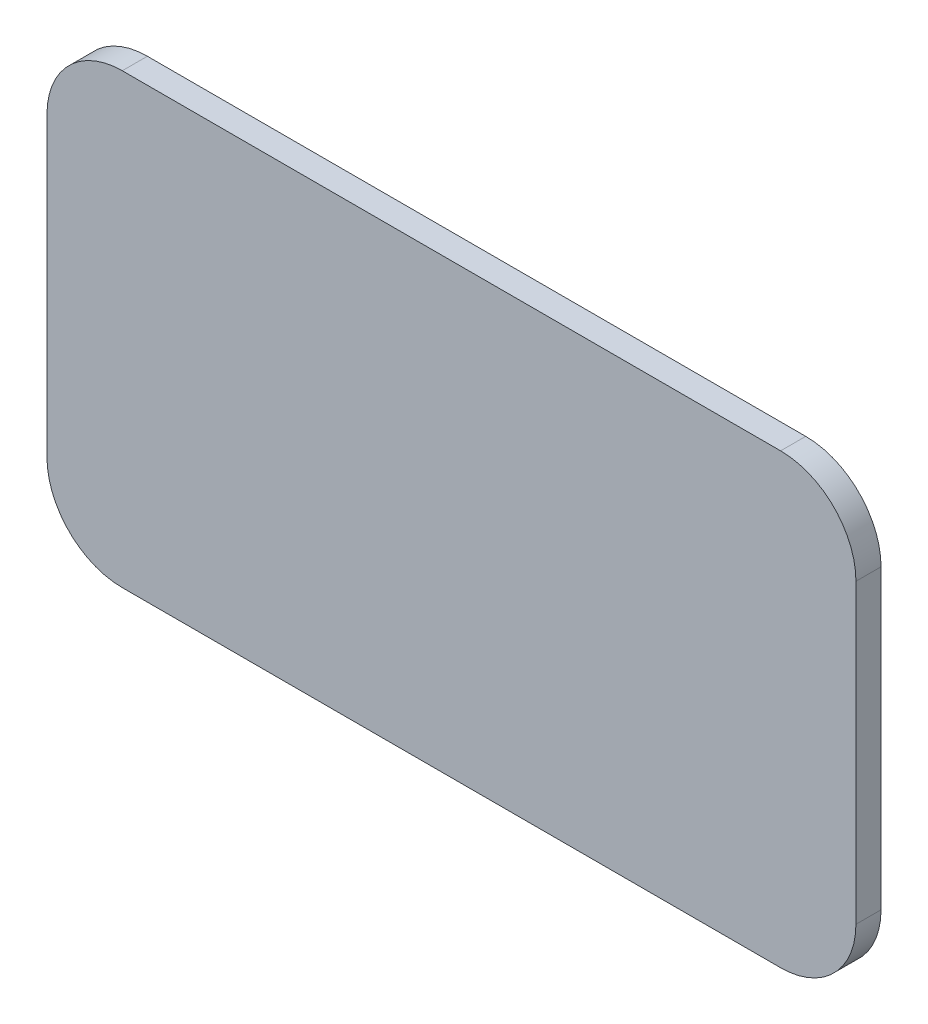
ISO-10303-21;
HEADER;
FILE_DESCRIPTION(('STEP AP214'),'2;1');
FILE_NAME('part.step','',(''),(''),'','','');
FILE_SCHEMA(('AUTOMOTIVE_DESIGN { 1 0 10303 214 1 1 1 1 }'));
ENDSEC;
DATA;
#1=APPLICATION_CONTEXT('core data for automotive mechanical design processes');
#2=APPLICATION_PROTOCOL_DEFINITION('international standard','automotive_design',2000,#1);
#3=PRODUCT_CONTEXT('',#1,'mechanical');
#4=PRODUCT('Part','Part','',(#3));
#5=PRODUCT_RELATED_PRODUCT_CATEGORY('part','',(#4));
#6=PRODUCT_DEFINITION_FORMATION('','',#4);
#7=PRODUCT_DEFINITION_CONTEXT('part definition',#1,'design');
#8=PRODUCT_DEFINITION('design','',#6,#7);
#9=PRODUCT_DEFINITION_SHAPE('','',#8);
#10=(LENGTH_UNIT() NAMED_UNIT(*) SI_UNIT(.MILLI.,.METRE.));
#11=(NAMED_UNIT(*) PLANE_ANGLE_UNIT() SI_UNIT($,.RADIAN.));
#12=(NAMED_UNIT(*) SI_UNIT($,.STERADIAN.) SOLID_ANGLE_UNIT());
#13=UNCERTAINTY_MEASURE_WITH_UNIT(LENGTH_MEASURE(1.E-05),#10,'distance_accuracy_value','');
#14=(GEOMETRIC_REPRESENTATION_CONTEXT(3) GLOBAL_UNCERTAINTY_ASSIGNED_CONTEXT((#13)) GLOBAL_UNIT_ASSIGNED_CONTEXT((#10,
#11,#12)) REPRESENTATION_CONTEXT('',''));
#15=CARTESIAN_POINT('',(0.,0.,0.));
#16=DIRECTION('',(0.,0.,1.));
#17=DIRECTION('',(1.,0.,0.));
#18=AXIS2_PLACEMENT_3D('',#15,#16,#17);
#19=CARTESIAN_POINT('',(-220.35,7.00000000000003,-6.));
#20=DIRECTION('',(0.,0.,1.));
#21=DIRECTION('',(-1.,0.,0.));
#22=AXIS2_PLACEMENT_3D('',#19,#20,#21);
#23=CYLINDRICAL_SURFACE('',#22,18.);
#24=CARTESIAN_POINT('',(-220.35,7.00000000000003,0.));
#25=DIRECTION('',(0.,0.,1.));
#26=DIRECTION('',(1.,0.,0.));
#27=AXIS2_PLACEMENT_3D('',#24,#25,#26);
#28=CIRCLE('',#27,18.);
#29=CARTESIAN_POINT('',(-238.35,7.00000000000002,0.));
#30=VERTEX_POINT('',#29);
#31=CARTESIAN_POINT('',(-220.35,-11.,0.));
#32=VERTEX_POINT('',#31);
#33=EDGE_CURVE('E131',#30,#32,#28,.T.);
#34=ORIENTED_EDGE('',*,*,#33,.F.);
#35=DIRECTION('',(0.,0.,1.));
#36=VECTOR('',#35,1.);
#37=CARTESIAN_POINT('',(-238.35,7.00000000000002,-6.));
#38=LINE('',#37,#36);
#39=CARTESIAN_POINT('',(-238.35,7.00000000000002,-6.));
#40=VERTEX_POINT('',#39);
#41=EDGE_CURVE('E130',#40,#30,#38,.T.);
#42=ORIENTED_EDGE('',*,*,#41,.F.);
#43=CARTESIAN_POINT('',(-220.35,7.00000000000003,-6.));
#44=DIRECTION('',(0.,0.,1.));
#45=DIRECTION('',(1.,0.,0.));
#46=AXIS2_PLACEMENT_3D('',#43,#44,#45);
#47=CIRCLE('',#46,18.);
#48=CARTESIAN_POINT('',(-220.35,-11.,-6.));
#49=VERTEX_POINT('',#48);
#50=EDGE_CURVE('E149',#40,#49,#47,.T.);
#51=ORIENTED_EDGE('',*,*,#50,.T.);
#52=DIRECTION('',(0.,0.,1.));
#53=VECTOR('',#52,1.);
#54=CARTESIAN_POINT('',(-220.35,-11.,-6.));
#55=LINE('',#54,#53);
#56=EDGE_CURVE('E11',#49,#32,#55,.T.);
#57=ORIENTED_EDGE('',*,*,#56,.T.);
#58=EDGE_LOOP('',(#34,#42,#51,#57));
#59=FACE_BOUND('',#58,.T.);
#60=ADVANCED_FACE('F35',(#59),#23,.T.);
#61=CARTESIAN_POINT('',(-220.35,-11.,-6.));
#62=DIRECTION('',(0.,1.,0.));
#63=DIRECTION('',(-1.,0.,0.));
#64=AXIS2_PLACEMENT_3D('',#61,#62,#63);
#65=PLANE('',#64);
#66=DIRECTION('',(1.,0.,0.));
#67=VECTOR('',#66,1.);
#68=CARTESIAN_POINT('',(-220.35,-11.,0.));
#69=LINE('',#68,#67);
#70=CARTESIAN_POINT('',(-62.991811866727,-11.,0.));
#71=VERTEX_POINT('',#70);
#72=EDGE_CURVE('E133',#32,#71,#69,.T.);
#73=ORIENTED_EDGE('',*,*,#72,.F.);
#74=ORIENTED_EDGE('',*,*,#56,.F.);
#75=DIRECTION('',(1.,0.,0.));
#76=VECTOR('',#75,1.);
#77=CARTESIAN_POINT('',(-220.35,-11.,-6.));
#78=LINE('',#77,#76);
#79=CARTESIAN_POINT('',(-62.991811866727,-11.,-6.));
#80=VERTEX_POINT('',#79);
#81=EDGE_CURVE('E89',#49,#80,#78,.T.);
#82=ORIENTED_EDGE('',*,*,#81,.T.);
#83=DIRECTION('',(0.,0.,1.));
#84=VECTOR('',#83,1.);
#85=CARTESIAN_POINT('',(-62.991811866727,-11.,-6.));
#86=LINE('',#85,#84);
#87=EDGE_CURVE('E43',#80,#71,#86,.T.);
#88=ORIENTED_EDGE('',*,*,#87,.T.);
#89=EDGE_LOOP('',(#73,#74,#82,#88));
#90=FACE_BOUND('',#89,.T.);
#91=ADVANCED_FACE('F161',(#90),#65,.F.);
#92=CARTESIAN_POINT('',(-62.991811866727,7.,-6.));
#93=DIRECTION('',(0.,0.,1.));
#94=DIRECTION('',(-1.,0.,0.));
#95=AXIS2_PLACEMENT_3D('',#92,#93,#94);
#96=CYLINDRICAL_SURFACE('',#95,18.);
#97=CARTESIAN_POINT('',(-62.991811866727,7.,0.));
#98=DIRECTION('',(0.,0.,1.));
#99=DIRECTION('',(1.,0.,0.));
#100=AXIS2_PLACEMENT_3D('',#97,#98,#99);
#101=CIRCLE('',#100,18.);
#102=CARTESIAN_POINT('',(-44.991811866727,7.,0.));
#103=VERTEX_POINT('',#102);
#104=EDGE_CURVE('E136',#71,#103,#101,.T.);
#105=ORIENTED_EDGE('',*,*,#104,.F.);
#106=ORIENTED_EDGE('',*,*,#87,.F.);
#107=CARTESIAN_POINT('',(-62.991811866727,7.,-6.));
#108=DIRECTION('',(0.,0.,1.));
#109=DIRECTION('',(1.,0.,0.));
#110=AXIS2_PLACEMENT_3D('',#107,#108,#109);
#111=CIRCLE('',#110,18.);
#112=CARTESIAN_POINT('',(-44.991811866727,7.,-6.));
#113=VERTEX_POINT('',#112);
#114=EDGE_CURVE('E170',#80,#113,#111,.T.);
#115=ORIENTED_EDGE('',*,*,#114,.T.);
#116=DIRECTION('',(0.,0.,1.));
#117=VECTOR('',#116,1.);
#118=CARTESIAN_POINT('',(-44.991811866727,7.,-6.));
#119=LINE('',#118,#117);
#120=EDGE_CURVE('E156',#113,#103,#119,.T.);
#121=ORIENTED_EDGE('',*,*,#120,.T.);
#122=EDGE_LOOP('',(#105,#106,#115,#121));
#123=FACE_BOUND('',#122,.T.);
#124=ADVANCED_FACE('F180',(#123),#96,.T.);
#125=CARTESIAN_POINT('',(-44.991811866727,7.,-6.));
#126=DIRECTION('',(-1.,0.,0.));
#127=DIRECTION('',(0.,-1.,0.));
#128=AXIS2_PLACEMENT_3D('',#125,#126,#127);
#129=PLANE('',#128);
#130=DIRECTION('',(0.,1.,0.));
#131=VECTOR('',#130,1.);
#132=CARTESIAN_POINT('',(-44.991811866727,7.,0.));
#133=LINE('',#132,#131);
#134=CARTESIAN_POINT('',(-44.991811866727,77.9999999999999,0.));
#135=VERTEX_POINT('',#134);
#136=EDGE_CURVE('E139',#103,#135,#133,.T.);
#137=ORIENTED_EDGE('',*,*,#136,.F.);
#138=ORIENTED_EDGE('',*,*,#120,.F.);
#139=DIRECTION('',(0.,1.,0.));
#140=VECTOR('',#139,1.);
#141=CARTESIAN_POINT('',(-44.991811866727,7.,-6.));
#142=LINE('',#141,#140);
#143=CARTESIAN_POINT('',(-44.991811866727,77.9999999999999,-6.));
#144=VERTEX_POINT('',#143);
#145=EDGE_CURVE('E125',#113,#144,#142,.T.);
#146=ORIENTED_EDGE('',*,*,#145,.T.);
#147=DIRECTION('',(0.,0.,1.));
#148=VECTOR('',#147,1.);
#149=CARTESIAN_POINT('',(-44.991811866727,77.9999999999999,-6.));
#150=LINE('',#149,#148);
#151=EDGE_CURVE('E153',#144,#135,#150,.T.);
#152=ORIENTED_EDGE('',*,*,#151,.T.);
#153=EDGE_LOOP('',(#137,#138,#146,#152));
#154=FACE_BOUND('',#153,.T.);
#155=ADVANCED_FACE('F176',(#154),#129,.F.);
#156=CARTESIAN_POINT('',(-62.991811866727,78.,-6.));
#157=DIRECTION('',(0.,0.,1.));
#158=DIRECTION('',(-1.,0.,0.));
#159=AXIS2_PLACEMENT_3D('',#156,#157,#158);
#160=CYLINDRICAL_SURFACE('',#159,18.);
#161=CARTESIAN_POINT('',(-62.991811866727,78.,0.));
#162=DIRECTION('',(0.,0.,1.));
#163=DIRECTION('',(1.,0.,0.));
#164=AXIS2_PLACEMENT_3D('',#161,#162,#163);
#165=CIRCLE('',#164,18.);
#166=CARTESIAN_POINT('',(-62.9918118667271,96.,0.));
#167=VERTEX_POINT('',#166);
#168=EDGE_CURVE('E142',#135,#167,#165,.T.);
#169=ORIENTED_EDGE('',*,*,#168,.F.);
#170=ORIENTED_EDGE('',*,*,#151,.F.);
#171=CARTESIAN_POINT('',(-62.991811866727,78.,-6.));
#172=DIRECTION('',(0.,0.,1.));
#173=DIRECTION('',(1.,0.,0.));
#174=AXIS2_PLACEMENT_3D('',#171,#172,#173);
#175=CIRCLE('',#174,18.);
#176=CARTESIAN_POINT('',(-62.9918118667271,96.,-6.));
#177=VERTEX_POINT('',#176);
#178=EDGE_CURVE('E123',#144,#177,#175,.T.);
#179=ORIENTED_EDGE('',*,*,#178,.T.);
#180=DIRECTION('',(0.,0.,1.));
#181=VECTOR('',#180,1.);
#182=CARTESIAN_POINT('',(-62.9918118667271,96.,-6.));
#183=LINE('',#182,#181);
#184=EDGE_CURVE('E117',#177,#167,#183,.T.);
#185=ORIENTED_EDGE('',*,*,#184,.T.);
#186=EDGE_LOOP('',(#169,#170,#179,#185));
#187=FACE_BOUND('',#186,.T.);
#188=ADVANCED_FACE('F179',(#187),#160,.T.);
#189=CARTESIAN_POINT('',(-62.9918118667271,96.,-6.));
#190=DIRECTION('',(0.,-1.,0.));
#191=DIRECTION('',(1.,0.,0.));
#192=AXIS2_PLACEMENT_3D('',#189,#190,#191);
#193=PLANE('',#192);
#194=DIRECTION('',(-1.,0.,0.));
#195=VECTOR('',#194,1.);
#196=CARTESIAN_POINT('',(-62.9918118667271,96.,0.));
#197=LINE('',#196,#195);
#198=CARTESIAN_POINT('',(-220.35,96.0000000000001,0.));
#199=VERTEX_POINT('',#198);
#200=EDGE_CURVE('E145',#167,#199,#197,.T.);
#201=ORIENTED_EDGE('',*,*,#200,.F.);
#202=ORIENTED_EDGE('',*,*,#184,.F.);
#203=DIRECTION('',(-1.,0.,0.));
#204=VECTOR('',#203,1.);
#205=CARTESIAN_POINT('',(-62.9918118667271,96.,-6.));
#206=LINE('',#205,#204);
#207=CARTESIAN_POINT('',(-220.35,96.0000000000001,-6.));
#208=VERTEX_POINT('',#207);
#209=EDGE_CURVE('E107',#177,#208,#206,.T.);
#210=ORIENTED_EDGE('',*,*,#209,.T.);
#211=DIRECTION('',(0.,0.,1.));
#212=VECTOR('',#211,1.);
#213=CARTESIAN_POINT('',(-220.35,96.0000000000001,-6.));
#214=LINE('',#213,#212);
#215=EDGE_CURVE('E112',#208,#199,#214,.T.);
#216=ORIENTED_EDGE('',*,*,#215,.T.);
#217=EDGE_LOOP('',(#201,#202,#210,#216));
#218=FACE_BOUND('',#217,.T.);
#219=ADVANCED_FACE('F120',(#218),#193,.F.);
#220=CARTESIAN_POINT('',(-220.35,78.0000000000001,-6.));
#221=DIRECTION('',(0.,0.,1.));
#222=DIRECTION('',(-1.,0.,0.));
#223=AXIS2_PLACEMENT_3D('',#220,#221,#222);
#224=CYLINDRICAL_SURFACE('',#223,18.);
#225=CARTESIAN_POINT('',(-220.35,78.0000000000001,0.));
#226=DIRECTION('',(0.,0.,1.));
#227=DIRECTION('',(1.,0.,0.));
#228=AXIS2_PLACEMENT_3D('',#225,#226,#227);
#229=CIRCLE('',#228,18.);
#230=CARTESIAN_POINT('',(-238.35,77.9999999999999,0.));
#231=VERTEX_POINT('',#230);
#232=EDGE_CURVE('E114',#199,#231,#229,.T.);
#233=ORIENTED_EDGE('',*,*,#232,.F.);
#234=ORIENTED_EDGE('',*,*,#215,.F.);
#235=CARTESIAN_POINT('',(-220.35,78.0000000000001,-6.));
#236=DIRECTION('',(0.,0.,1.));
#237=DIRECTION('',(1.,0.,0.));
#238=AXIS2_PLACEMENT_3D('',#235,#236,#237);
#239=CIRCLE('',#238,18.);
#240=CARTESIAN_POINT('',(-238.35,77.9999999999999,-6.));
#241=VERTEX_POINT('',#240);
#242=EDGE_CURVE('E103',#208,#241,#239,.T.);
#243=ORIENTED_EDGE('',*,*,#242,.T.);
#244=DIRECTION('',(0.,0.,1.));
#245=VECTOR('',#244,1.);
#246=CARTESIAN_POINT('',(-238.35,77.9999999999999,-6.));
#247=LINE('',#246,#245);
#248=EDGE_CURVE('E118',#241,#231,#247,.T.);
#249=ORIENTED_EDGE('',*,*,#248,.T.);
#250=EDGE_LOOP('',(#233,#234,#243,#249));
#251=FACE_BOUND('',#250,.T.);
#252=ADVANCED_FACE('F113',(#251),#224,.T.);
#253=CARTESIAN_POINT('',(-238.35,77.9999999999999,-6.));
#254=DIRECTION('',(1.,0.,0.));
#255=DIRECTION('',(0.,1.,0.));
#256=AXIS2_PLACEMENT_3D('',#253,#254,#255);
#257=PLANE('',#256);
#258=DIRECTION('',(0.,-1.,0.));
#259=VECTOR('',#258,1.);
#260=CARTESIAN_POINT('',(-238.35,77.9999999999999,0.));
#261=LINE('',#260,#259);
#262=EDGE_CURVE('E77',#231,#30,#261,.T.);
#263=ORIENTED_EDGE('',*,*,#262,.F.);
#264=ORIENTED_EDGE('',*,*,#248,.F.);
#265=DIRECTION('',(0.,-1.,0.));
#266=VECTOR('',#265,1.);
#267=CARTESIAN_POINT('',(-238.35,77.9999999999999,-6.));
#268=LINE('',#267,#266);
#269=EDGE_CURVE('E51',#241,#40,#268,.T.);
#270=ORIENTED_EDGE('',*,*,#269,.T.);
#271=ORIENTED_EDGE('',*,*,#41,.T.);
#272=EDGE_LOOP('',(#263,#264,#270,#271));
#273=FACE_BOUND('',#272,.T.);
#274=ADVANCED_FACE('F230',(#273),#257,.F.);
#275=CARTESIAN_POINT('',(-220.35,7.00000000000003,-6.));
#276=DIRECTION('',(0.,0.,-1.));
#277=DIRECTION('',(1.,0.,0.));
#278=AXIS2_PLACEMENT_3D('',#275,#276,#277);
#279=PLANE('',#278);
#280=ORIENTED_EDGE('',*,*,#50,.F.);
#281=ORIENTED_EDGE('',*,*,#269,.F.);
#282=ORIENTED_EDGE('',*,*,#242,.F.);
#283=ORIENTED_EDGE('',*,*,#209,.F.);
#284=ORIENTED_EDGE('',*,*,#178,.F.);
#285=ORIENTED_EDGE('',*,*,#145,.F.);
#286=ORIENTED_EDGE('',*,*,#114,.F.);
#287=ORIENTED_EDGE('',*,*,#81,.F.);
#288=EDGE_LOOP('',(#280,#281,#282,#283,#284,#285,#286,#287));
#289=FACE_BOUND('',#288,.T.);
#290=ADVANCED_FACE('F105',(#289),#279,.T.);
#291=CARTESIAN_POINT('',(-220.35,7.00000000000003,0.));
#292=DIRECTION('',(0.,0.,-1.));
#293=DIRECTION('',(1.,0.,0.));
#294=AXIS2_PLACEMENT_3D('',#291,#292,#293);
#295=PLANE('',#294);
#296=ORIENTED_EDGE('',*,*,#33,.T.);
#297=ORIENTED_EDGE('',*,*,#72,.T.);
#298=ORIENTED_EDGE('',*,*,#104,.T.);
#299=ORIENTED_EDGE('',*,*,#136,.T.);
#300=ORIENTED_EDGE('',*,*,#168,.T.);
#301=ORIENTED_EDGE('',*,*,#200,.T.);
#302=ORIENTED_EDGE('',*,*,#232,.T.);
#303=ORIENTED_EDGE('',*,*,#262,.T.);
#304=EDGE_LOOP('',(#296,#297,#298,#299,#300,#301,#302,#303));
#305=FACE_BOUND('',#304,.T.);
#306=ADVANCED_FACE('F164',(#305),#295,.F.);
#307=CLOSED_SHELL('',(#60,#91,#124,#155,#188,#219,#252,#274,#290,#306));
#308=MANIFOLD_SOLID_BREP('B2',#307);
#309=ADVANCED_BREP_SHAPE_REPRESENTATION('',(#18,#308),#14);
#310=SHAPE_DEFINITION_REPRESENTATION(#9,#309);
ENDSEC;
END-ISO-10303-21;
